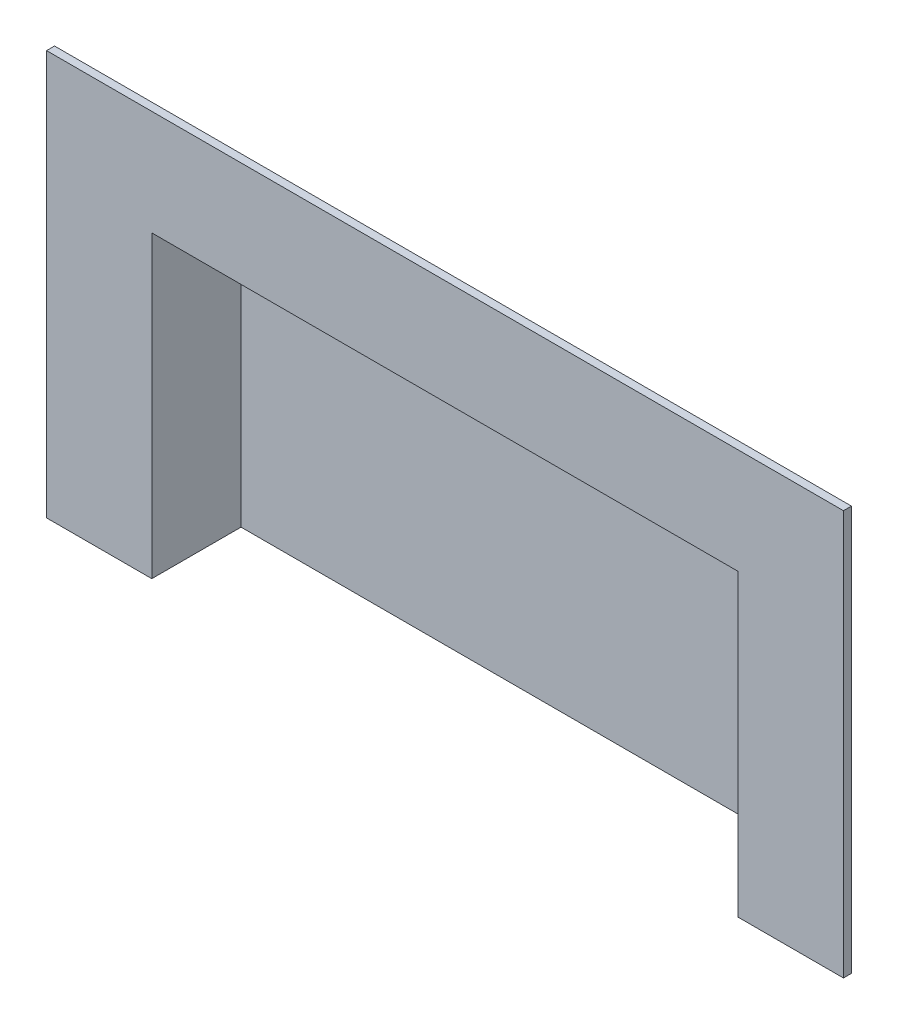
ISO-10303-21;
HEADER;
FILE_DESCRIPTION(('STEP AP214'),'2;1');
FILE_NAME('part.step','',(''),(''),'','','');
FILE_SCHEMA(('AUTOMOTIVE_DESIGN { 1 0 10303 214 1 1 1 1 }'));
ENDSEC;
DATA;
#1=APPLICATION_CONTEXT('core data for automotive mechanical design processes');
#2=APPLICATION_PROTOCOL_DEFINITION('international standard','automotive_design',2000,#1);
#3=PRODUCT_CONTEXT('',#1,'mechanical');
#4=PRODUCT('Part','Part','',(#3));
#5=PRODUCT_RELATED_PRODUCT_CATEGORY('part','',(#4));
#6=PRODUCT_DEFINITION_FORMATION('','',#4);
#7=PRODUCT_DEFINITION_CONTEXT('part definition',#1,'design');
#8=PRODUCT_DEFINITION('design','',#6,#7);
#9=PRODUCT_DEFINITION_SHAPE('','',#8);
#10=(LENGTH_UNIT() NAMED_UNIT(*) SI_UNIT(.MILLI.,.METRE.));
#11=(NAMED_UNIT(*) PLANE_ANGLE_UNIT() SI_UNIT($,.RADIAN.));
#12=(NAMED_UNIT(*) SI_UNIT($,.STERADIAN.) SOLID_ANGLE_UNIT());
#13=UNCERTAINTY_MEASURE_WITH_UNIT(LENGTH_MEASURE(1.E-05),#10,'distance_accuracy_value','');
#14=(GEOMETRIC_REPRESENTATION_CONTEXT(3) GLOBAL_UNCERTAINTY_ASSIGNED_CONTEXT((#13)) GLOBAL_UNIT_ASSIGNED_CONTEXT((#10,
#11,#12)) REPRESENTATION_CONTEXT('',''));
#15=CARTESIAN_POINT('',(0.,0.,0.));
#16=DIRECTION('',(0.,0.,1.));
#17=DIRECTION('',(1.,0.,0.));
#18=AXIS2_PLACEMENT_3D('',#15,#16,#17);
#19=CARTESIAN_POINT('',(48.,-24.5,15.494));
#20=DIRECTION('',(-1.,0.,0.));
#21=DIRECTION('',(0.,0.,1.));
#22=AXIS2_PLACEMENT_3D('',#19,#20,#21);
#23=PLANE('',#22);
#24=DIRECTION('',(0.,0.,-1.));
#25=VECTOR('',#24,1.);
#26=CARTESIAN_POINT('',(48.,24.5,15.494));
#27=LINE('',#26,#25);
#28=CARTESIAN_POINT('',(48.,24.5,14.224));
#29=VERTEX_POINT('',#28);
#30=CARTESIAN_POINT('',(48.,24.5,0.));
#31=VERTEX_POINT('',#30);
#32=EDGE_CURVE('E11',#29,#31,#27,.T.);
#33=ORIENTED_EDGE('',*,*,#32,.F.);
#34=DIRECTION('',(0.,-1.,0.));
#35=VECTOR('',#34,1.);
#36=CARTESIAN_POINT('',(48.,-24.5,14.224));
#37=LINE('',#36,#35);
#38=CARTESIAN_POINT('',(48.,-24.5,14.224));
#39=VERTEX_POINT('',#38);
#40=EDGE_CURVE('E203',#29,#39,#37,.T.);
#41=ORIENTED_EDGE('',*,*,#40,.T.);
#42=DIRECTION('',(0.,0.,-1.));
#43=VECTOR('',#42,1.);
#44=CARTESIAN_POINT('',(48.,-24.5,15.494));
#45=LINE('',#44,#43);
#46=CARTESIAN_POINT('',(48.,-24.5,0.));
#47=VERTEX_POINT('',#46);
#48=EDGE_CURVE('E63',#39,#47,#45,.T.);
#49=ORIENTED_EDGE('',*,*,#48,.T.);
#50=DIRECTION('',(0.,1.,0.));
#51=VECTOR('',#50,1.);
#52=CARTESIAN_POINT('',(48.,-24.5,0.));
#53=LINE('',#52,#51);
#54=EDGE_CURVE('E205',#47,#31,#53,.T.);
#55=ORIENTED_EDGE('',*,*,#54,.T.);
#56=EDGE_LOOP('',(#33,#41,#49,#55));
#57=FACE_BOUND('',#56,.T.);
#58=ADVANCED_FACE('F41',(#57),#23,.F.);
#59=CARTESIAN_POINT('',(-48.,24.5,15.494));
#60=DIRECTION('',(0.,-1.,0.));
#61=DIRECTION('',(0.,0.,-1.));
#62=AXIS2_PLACEMENT_3D('',#59,#60,#61);
#63=PLANE('',#62);
#64=DIRECTION('',(0.,0.,-1.));
#65=VECTOR('',#64,1.);
#66=CARTESIAN_POINT('',(-48.,24.5,15.494));
#67=LINE('',#66,#65);
#68=CARTESIAN_POINT('',(-48.,24.5,14.224));
#69=VERTEX_POINT('',#68);
#70=CARTESIAN_POINT('',(-48.,24.5,0.));
#71=VERTEX_POINT('',#70);
#72=EDGE_CURVE('E48',#69,#71,#67,.T.);
#73=ORIENTED_EDGE('',*,*,#72,.F.);
#74=DIRECTION('',(1.,0.,0.));
#75=VECTOR('',#74,1.);
#76=CARTESIAN_POINT('',(-48.,24.5,14.224));
#77=LINE('',#76,#75);
#78=EDGE_CURVE('E200',#69,#29,#77,.T.);
#79=ORIENTED_EDGE('',*,*,#78,.T.);
#80=ORIENTED_EDGE('',*,*,#32,.T.);
#81=DIRECTION('',(-1.,0.,0.));
#82=VECTOR('',#81,1.);
#83=CARTESIAN_POINT('',(-48.,24.5,0.));
#84=LINE('',#83,#82);
#85=EDGE_CURVE('E211',#31,#71,#84,.T.);
#86=ORIENTED_EDGE('',*,*,#85,.T.);
#87=EDGE_LOOP('',(#73,#79,#80,#86));
#88=FACE_BOUND('',#87,.T.);
#89=ADVANCED_FACE('F229',(#88),#63,.F.);
#90=CARTESIAN_POINT('',(-48.,-24.5,15.494));
#91=DIRECTION('',(1.,0.,0.));
#92=DIRECTION('',(0.,0.,-1.));
#93=AXIS2_PLACEMENT_3D('',#90,#91,#92);
#94=PLANE('',#93);
#95=DIRECTION('',(0.,0.,-1.));
#96=VECTOR('',#95,1.);
#97=CARTESIAN_POINT('',(-48.,-24.5,15.494));
#98=LINE('',#97,#96);
#99=CARTESIAN_POINT('',(-48.,-24.5,14.224));
#100=VERTEX_POINT('',#99);
#101=CARTESIAN_POINT('',(-48.,-24.5,0.));
#102=VERTEX_POINT('',#101);
#103=EDGE_CURVE('E220',#100,#102,#98,.T.);
#104=ORIENTED_EDGE('',*,*,#103,.F.);
#105=DIRECTION('',(0.,1.,0.));
#106=VECTOR('',#105,1.);
#107=CARTESIAN_POINT('',(-48.,-24.5,14.224));
#108=LINE('',#107,#106);
#109=EDGE_CURVE('E190',#100,#69,#108,.T.);
#110=ORIENTED_EDGE('',*,*,#109,.T.);
#111=ORIENTED_EDGE('',*,*,#72,.T.);
#112=DIRECTION('',(0.,-1.,0.));
#113=VECTOR('',#112,1.);
#114=CARTESIAN_POINT('',(-48.,-24.5,0.));
#115=LINE('',#114,#113);
#116=EDGE_CURVE('E214',#71,#102,#115,.T.);
#117=ORIENTED_EDGE('',*,*,#116,.T.);
#118=EDGE_LOOP('',(#104,#110,#111,#117));
#119=FACE_BOUND('',#118,.T.);
#120=ADVANCED_FACE('F224',(#119),#94,.F.);
#121=CARTESIAN_POINT('',(-48.,-24.5,15.494));
#122=DIRECTION('',(0.,1.,0.));
#123=DIRECTION('',(0.,0.,1.));
#124=AXIS2_PLACEMENT_3D('',#121,#122,#123);
#125=PLANE('',#124);
#126=DIRECTION('',(1.,0.,0.));
#127=VECTOR('',#126,1.);
#128=CARTESIAN_POINT('',(-48.,-24.5,15.494));
#129=LINE('',#128,#127);
#130=CARTESIAN_POINT('',(46.73,-24.5,15.494));
#131=VERTEX_POINT('',#130);
#132=CARTESIAN_POINT('',(63.5,-24.5,15.494));
#133=VERTEX_POINT('',#132);
#134=EDGE_CURVE('E209',#131,#133,#129,.T.);
#135=ORIENTED_EDGE('',*,*,#134,.F.);
#136=DIRECTION('',(0.,0.,-1.));
#137=VECTOR('',#136,1.);
#138=CARTESIAN_POINT('',(46.73,-24.5,15.494));
#139=LINE('',#138,#137);
#140=CARTESIAN_POINT('',(46.73,-24.5,1.27));
#141=VERTEX_POINT('',#140);
#142=EDGE_CURVE('E162',#131,#141,#139,.T.);
#143=ORIENTED_EDGE('',*,*,#142,.T.);
#144=DIRECTION('',(1.,0.,0.));
#145=VECTOR('',#144,1.);
#146=CARTESIAN_POINT('',(0.,-24.5,1.27));
#147=LINE('',#146,#145);
#148=CARTESIAN_POINT('',(-46.73,-24.5,1.27));
#149=VERTEX_POINT('',#148);
#150=EDGE_CURVE('E150',#149,#141,#147,.T.);
#151=ORIENTED_EDGE('',*,*,#150,.F.);
#152=DIRECTION('',(0.,0.,-1.));
#153=VECTOR('',#152,1.);
#154=CARTESIAN_POINT('',(-46.73,-24.5,15.494));
#155=LINE('',#154,#153);
#156=CARTESIAN_POINT('',(-46.73,-24.5,15.494));
#157=VERTEX_POINT('',#156);
#158=EDGE_CURVE('E156',#157,#149,#155,.T.);
#159=ORIENTED_EDGE('',*,*,#158,.F.);
#160=CARTESIAN_POINT('',(-63.5,-24.5,15.494));
#161=VERTEX_POINT('',#160);
#162=EDGE_CURVE('E206',#161,#157,#129,.T.);
#163=ORIENTED_EDGE('',*,*,#162,.F.);
#164=DIRECTION('',(0.,0.,1.));
#165=VECTOR('',#164,1.);
#166=CARTESIAN_POINT('',(-63.5,-24.5,14.224));
#167=LINE('',#166,#165);
#168=CARTESIAN_POINT('',(-63.5,-24.5,14.224));
#169=VERTEX_POINT('',#168);
#170=EDGE_CURVE('E180',#169,#161,#167,.T.);
#171=ORIENTED_EDGE('',*,*,#170,.F.);
#172=DIRECTION('',(1.,0.,0.));
#173=VECTOR('',#172,1.);
#174=CARTESIAN_POINT('',(-63.5,-24.5,14.224));
#175=LINE('',#174,#173);
#176=EDGE_CURVE('E171',#169,#100,#175,.T.);
#177=ORIENTED_EDGE('',*,*,#176,.T.);
#178=ORIENTED_EDGE('',*,*,#103,.T.);
#179=DIRECTION('',(1.,0.,0.));
#180=VECTOR('',#179,1.);
#181=CARTESIAN_POINT('',(-48.,-24.5,0.));
#182=LINE('',#181,#180);
#183=EDGE_CURVE('E217',#102,#47,#182,.T.);
#184=ORIENTED_EDGE('',*,*,#183,.T.);
#185=ORIENTED_EDGE('',*,*,#48,.F.);
#186=CARTESIAN_POINT('',(63.5,-24.5,14.224));
#187=VERTEX_POINT('',#186);
#188=EDGE_CURVE('E169',#39,#187,#175,.T.);
#189=ORIENTED_EDGE('',*,*,#188,.T.);
#190=DIRECTION('',(0.,0.,1.));
#191=VECTOR('',#190,1.);
#192=CARTESIAN_POINT('',(63.5,-24.5,14.224));
#193=LINE('',#192,#191);
#194=EDGE_CURVE('E193',#187,#133,#193,.T.);
#195=ORIENTED_EDGE('',*,*,#194,.T.);
#196=EDGE_LOOP('',(#135,#143,#151,#159,#163,#171,#177,#178,#184,#185,#189,#195));
#197=FACE_BOUND('',#196,.T.);
#198=ADVANCED_FACE('F236',(#197),#125,.F.);
#199=CARTESIAN_POINT('',(0.,0.,15.494));
#200=DIRECTION('',(0.,0.,-1.));
#201=DIRECTION('',(-1.,0.,0.));
#202=AXIS2_PLACEMENT_3D('',#199,#200,#201);
#203=PLANE('',#202);
#204=ORIENTED_EDGE('',*,*,#162,.T.);
#205=DIRECTION('',(0.,1.,0.));
#206=VECTOR('',#205,1.);
#207=CARTESIAN_POINT('',(-46.73,-24.5,15.494));
#208=LINE('',#207,#206);
#209=CARTESIAN_POINT('',(-46.73,23.23,15.494));
#210=VERTEX_POINT('',#209);
#211=EDGE_CURVE('E157',#157,#210,#208,.T.);
#212=ORIENTED_EDGE('',*,*,#211,.T.);
#213=DIRECTION('',(1.,0.,0.));
#214=VECTOR('',#213,1.);
#215=CARTESIAN_POINT('',(-48.,23.23,15.494));
#216=LINE('',#215,#214);
#217=CARTESIAN_POINT('',(46.73,23.23,15.494));
#218=VERTEX_POINT('',#217);
#219=EDGE_CURVE('E152',#210,#218,#216,.T.);
#220=ORIENTED_EDGE('',*,*,#219,.T.);
#221=DIRECTION('',(0.,-1.,0.));
#222=VECTOR('',#221,1.);
#223=CARTESIAN_POINT('',(46.73,-24.5,15.494));
#224=LINE('',#223,#222);
#225=EDGE_CURVE('E134',#218,#131,#224,.T.);
#226=ORIENTED_EDGE('',*,*,#225,.T.);
#227=ORIENTED_EDGE('',*,*,#134,.T.);
#228=DIRECTION('',(0.,1.,0.));
#229=VECTOR('',#228,1.);
#230=CARTESIAN_POINT('',(63.5,-24.5,15.494));
#231=LINE('',#230,#229);
#232=CARTESIAN_POINT('',(63.5,40.,15.494));
#233=VERTEX_POINT('',#232);
#234=EDGE_CURVE('E183',#133,#233,#231,.T.);
#235=ORIENTED_EDGE('',*,*,#234,.T.);
#236=DIRECTION('',(-1.,0.,0.));
#237=VECTOR('',#236,1.);
#238=CARTESIAN_POINT('',(-63.5,40.,15.494));
#239=LINE('',#238,#237);
#240=CARTESIAN_POINT('',(-63.5,40.,15.494));
#241=VERTEX_POINT('',#240);
#242=EDGE_CURVE('E170',#233,#241,#239,.T.);
#243=ORIENTED_EDGE('',*,*,#242,.T.);
#244=DIRECTION('',(0.,-1.,0.));
#245=VECTOR('',#244,1.);
#246=CARTESIAN_POINT('',(-63.5,-24.5,15.494));
#247=LINE('',#246,#245);
#248=EDGE_CURVE('E136',#241,#161,#247,.T.);
#249=ORIENTED_EDGE('',*,*,#248,.T.);
#250=EDGE_LOOP('',(#204,#212,#220,#226,#227,#235,#243,#249));
#251=FACE_BOUND('',#250,.T.);
#252=ADVANCED_FACE('F254',(#251),#203,.F.);
#253=CARTESIAN_POINT('',(0.,0.,0.));
#254=DIRECTION('',(0.,0.,-1.));
#255=DIRECTION('',(-1.,0.,0.));
#256=AXIS2_PLACEMENT_3D('',#253,#254,#255);
#257=PLANE('',#256);
#258=ORIENTED_EDGE('',*,*,#54,.F.);
#259=ORIENTED_EDGE('',*,*,#183,.F.);
#260=ORIENTED_EDGE('',*,*,#116,.F.);
#261=ORIENTED_EDGE('',*,*,#85,.F.);
#262=EDGE_LOOP('',(#258,#259,#260,#261));
#263=FACE_BOUND('',#262,.T.);
#264=ADVANCED_FACE('F233',(#263),#257,.T.);
#265=CARTESIAN_POINT('',(0.,0.,14.224));
#266=DIRECTION('',(0.,0.,-1.));
#267=DIRECTION('',(-1.,0.,0.));
#268=AXIS2_PLACEMENT_3D('',#265,#266,#267);
#269=PLANE('',#268);
#270=ORIENTED_EDGE('',*,*,#40,.F.);
#271=ORIENTED_EDGE('',*,*,#78,.F.);
#272=ORIENTED_EDGE('',*,*,#109,.F.);
#273=ORIENTED_EDGE('',*,*,#176,.F.);
#274=DIRECTION('',(0.,-1.,0.));
#275=VECTOR('',#274,1.);
#276=CARTESIAN_POINT('',(-63.5,-24.5,14.224));
#277=LINE('',#276,#275);
#278=CARTESIAN_POINT('',(-63.5,40.,14.224));
#279=VERTEX_POINT('',#278);
#280=EDGE_CURVE('E166',#279,#169,#277,.T.);
#281=ORIENTED_EDGE('',*,*,#280,.F.);
#282=DIRECTION('',(-1.,0.,0.));
#283=VECTOR('',#282,1.);
#284=CARTESIAN_POINT('',(-63.5,40.,14.224));
#285=LINE('',#284,#283);
#286=CARTESIAN_POINT('',(63.5,40.,14.224));
#287=VERTEX_POINT('',#286);
#288=EDGE_CURVE('E177',#287,#279,#285,.T.);
#289=ORIENTED_EDGE('',*,*,#288,.F.);
#290=DIRECTION('',(0.,1.,0.));
#291=VECTOR('',#290,1.);
#292=CARTESIAN_POINT('',(63.5,-24.5,14.224));
#293=LINE('',#292,#291);
#294=EDGE_CURVE('E174',#187,#287,#293,.T.);
#295=ORIENTED_EDGE('',*,*,#294,.F.);
#296=ORIENTED_EDGE('',*,*,#188,.F.);
#297=EDGE_LOOP('',(#270,#271,#272,#273,#281,#289,#295,#296));
#298=FACE_BOUND('',#297,.T.);
#299=ADVANCED_FACE('F240',(#298),#269,.T.);
#300=CARTESIAN_POINT('',(-63.5,-24.5,14.224));
#301=DIRECTION('',(-1.,0.,0.));
#302=DIRECTION('',(0.,0.,1.));
#303=AXIS2_PLACEMENT_3D('',#300,#301,#302);
#304=PLANE('',#303);
#305=ORIENTED_EDGE('',*,*,#248,.F.);
#306=DIRECTION('',(0.,0.,1.));
#307=VECTOR('',#306,1.);
#308=CARTESIAN_POINT('',(-63.5,40.,14.224));
#309=LINE('',#308,#307);
#310=EDGE_CURVE('E188',#279,#241,#309,.T.);
#311=ORIENTED_EDGE('',*,*,#310,.F.);
#312=ORIENTED_EDGE('',*,*,#280,.T.);
#313=ORIENTED_EDGE('',*,*,#170,.T.);
#314=EDGE_LOOP('',(#305,#311,#312,#313));
#315=FACE_BOUND('',#314,.T.);
#316=ADVANCED_FACE('F244',(#315),#304,.T.);
#317=CARTESIAN_POINT('',(-63.5,40.,14.224));
#318=DIRECTION('',(0.,1.,0.));
#319=DIRECTION('',(0.,0.,1.));
#320=AXIS2_PLACEMENT_3D('',#317,#318,#319);
#321=PLANE('',#320);
#322=ORIENTED_EDGE('',*,*,#242,.F.);
#323=DIRECTION('',(0.,0.,1.));
#324=VECTOR('',#323,1.);
#325=CARTESIAN_POINT('',(63.5,40.,14.224));
#326=LINE('',#325,#324);
#327=EDGE_CURVE('E191',#287,#233,#326,.T.);
#328=ORIENTED_EDGE('',*,*,#327,.F.);
#329=ORIENTED_EDGE('',*,*,#288,.T.);
#330=ORIENTED_EDGE('',*,*,#310,.T.);
#331=EDGE_LOOP('',(#322,#328,#329,#330));
#332=FACE_BOUND('',#331,.T.);
#333=ADVANCED_FACE('F247',(#332),#321,.T.);
#334=CARTESIAN_POINT('',(63.5,-24.5,14.224));
#335=DIRECTION('',(1.,0.,0.));
#336=DIRECTION('',(0.,0.,-1.));
#337=AXIS2_PLACEMENT_3D('',#334,#335,#336);
#338=PLANE('',#337);
#339=ORIENTED_EDGE('',*,*,#234,.F.);
#340=ORIENTED_EDGE('',*,*,#194,.F.);
#341=ORIENTED_EDGE('',*,*,#294,.T.);
#342=ORIENTED_EDGE('',*,*,#327,.T.);
#343=EDGE_LOOP('',(#339,#340,#341,#342));
#344=FACE_BOUND('',#343,.T.);
#345=ADVANCED_FACE('F252',(#344),#338,.T.);
#346=CARTESIAN_POINT('',(46.73,-24.5,15.494));
#347=DIRECTION('',(-1.,0.,0.));
#348=DIRECTION('',(0.,0.,1.));
#349=AXIS2_PLACEMENT_3D('',#346,#347,#348);
#350=PLANE('',#349);
#351=DIRECTION('',(0.,0.,-1.));
#352=VECTOR('',#351,1.);
#353=CARTESIAN_POINT('',(46.73,23.23,15.494));
#354=LINE('',#353,#352);
#355=CARTESIAN_POINT('',(46.73,23.23,1.27));
#356=VERTEX_POINT('',#355);
#357=EDGE_CURVE('E55',#218,#356,#354,.T.);
#358=ORIENTED_EDGE('',*,*,#357,.T.);
#359=DIRECTION('',(0.,1.,0.));
#360=VECTOR('',#359,1.);
#361=CARTESIAN_POINT('',(46.73,0.,1.27));
#362=LINE('',#361,#360);
#363=EDGE_CURVE('E131',#141,#356,#362,.T.);
#364=ORIENTED_EDGE('',*,*,#363,.F.);
#365=ORIENTED_EDGE('',*,*,#142,.F.);
#366=ORIENTED_EDGE('',*,*,#225,.F.);
#367=EDGE_LOOP('',(#358,#364,#365,#366));
#368=FACE_BOUND('',#367,.T.);
#369=ADVANCED_FACE('F129',(#368),#350,.T.);
#370=CARTESIAN_POINT('',(-48.,23.23,15.494));
#371=DIRECTION('',(0.,-1.,0.));
#372=DIRECTION('',(0.,0.,-1.));
#373=AXIS2_PLACEMENT_3D('',#370,#371,#372);
#374=PLANE('',#373);
#375=DIRECTION('',(0.,0.,-1.));
#376=VECTOR('',#375,1.);
#377=CARTESIAN_POINT('',(-46.73,23.23,15.494));
#378=LINE('',#377,#376);
#379=CARTESIAN_POINT('',(-46.73,23.23,1.27));
#380=VERTEX_POINT('',#379);
#381=EDGE_CURVE('E137',#210,#380,#378,.T.);
#382=ORIENTED_EDGE('',*,*,#381,.T.);
#383=DIRECTION('',(-1.,0.,0.));
#384=VECTOR('',#383,1.);
#385=CARTESIAN_POINT('',(0.,23.23,1.27));
#386=LINE('',#385,#384);
#387=EDGE_CURVE('E140',#356,#380,#386,.T.);
#388=ORIENTED_EDGE('',*,*,#387,.F.);
#389=ORIENTED_EDGE('',*,*,#357,.F.);
#390=ORIENTED_EDGE('',*,*,#219,.F.);
#391=EDGE_LOOP('',(#382,#388,#389,#390));
#392=FACE_BOUND('',#391,.T.);
#393=ADVANCED_FACE('F141',(#392),#374,.T.);
#394=CARTESIAN_POINT('',(-46.73,-24.5,15.494));
#395=DIRECTION('',(1.,0.,0.));
#396=DIRECTION('',(0.,0.,-1.));
#397=AXIS2_PLACEMENT_3D('',#394,#395,#396);
#398=PLANE('',#397);
#399=ORIENTED_EDGE('',*,*,#158,.T.);
#400=DIRECTION('',(0.,-1.,0.));
#401=VECTOR('',#400,1.);
#402=CARTESIAN_POINT('',(-46.73,0.,1.27));
#403=LINE('',#402,#401);
#404=EDGE_CURVE('E146',#380,#149,#403,.T.);
#405=ORIENTED_EDGE('',*,*,#404,.F.);
#406=ORIENTED_EDGE('',*,*,#381,.F.);
#407=ORIENTED_EDGE('',*,*,#211,.F.);
#408=EDGE_LOOP('',(#399,#405,#406,#407));
#409=FACE_BOUND('',#408,.T.);
#410=ADVANCED_FACE('F256',(#409),#398,.T.);
#411=CARTESIAN_POINT('',(0.,0.,1.27));
#412=DIRECTION('',(0.,0.,-1.));
#413=DIRECTION('',(-1.,0.,0.));
#414=AXIS2_PLACEMENT_3D('',#411,#412,#413);
#415=PLANE('',#414);
#416=ORIENTED_EDGE('',*,*,#363,.T.);
#417=ORIENTED_EDGE('',*,*,#387,.T.);
#418=ORIENTED_EDGE('',*,*,#404,.T.);
#419=ORIENTED_EDGE('',*,*,#150,.T.);
#420=EDGE_LOOP('',(#416,#417,#418,#419));
#421=FACE_BOUND('',#420,.T.);
#422=ADVANCED_FACE('F148',(#421),#415,.F.);
#423=CLOSED_SHELL('',(#58,#89,#120,#198,#252,#264,#299,#316,#333,#345,#369,#393,#410,#422));
#424=MANIFOLD_SOLID_BREP('B2',#423);
#425=ADVANCED_BREP_SHAPE_REPRESENTATION('',(#18,#424),#14);
#426=SHAPE_DEFINITION_REPRESENTATION(#9,#425);
ENDSEC;
END-ISO-10303-21;
